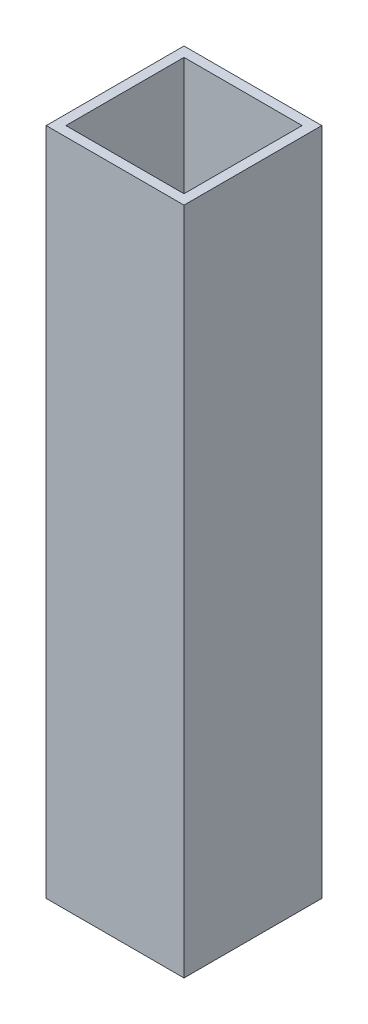
ISO-10303-21;
HEADER;
FILE_DESCRIPTION(('STEP AP214'),'2;1');
FILE_NAME('part.step','',(''),(''),'','','');
FILE_SCHEMA(('AUTOMOTIVE_DESIGN { 1 0 10303 214 1 1 1 1 }'));
ENDSEC;
DATA;
#1=APPLICATION_CONTEXT('core data for automotive mechanical design processes');
#2=APPLICATION_PROTOCOL_DEFINITION('international standard','automotive_design',2000,#1);
#3=PRODUCT_CONTEXT('',#1,'mechanical');
#4=PRODUCT('Part','Part','',(#3));
#5=PRODUCT_RELATED_PRODUCT_CATEGORY('part','',(#4));
#6=PRODUCT_DEFINITION_FORMATION('','',#4);
#7=PRODUCT_DEFINITION_CONTEXT('part definition',#1,'design');
#8=PRODUCT_DEFINITION('design','',#6,#7);
#9=PRODUCT_DEFINITION_SHAPE('','',#8);
#10=(LENGTH_UNIT() NAMED_UNIT(*) SI_UNIT(.MILLI.,.METRE.));
#11=(NAMED_UNIT(*) PLANE_ANGLE_UNIT() SI_UNIT($,.RADIAN.));
#12=(NAMED_UNIT(*) SI_UNIT($,.STERADIAN.) SOLID_ANGLE_UNIT());
#13=UNCERTAINTY_MEASURE_WITH_UNIT(LENGTH_MEASURE(1.E-05),#10,'distance_accuracy_value','');
#14=(GEOMETRIC_REPRESENTATION_CONTEXT(3) GLOBAL_UNCERTAINTY_ASSIGNED_CONTEXT((#13)) GLOBAL_UNIT_ASSIGNED_CONTEXT((#10,
#11,#12)) REPRESENTATION_CONTEXT('',''));
#15=CARTESIAN_POINT('',(0.,0.,0.));
#16=DIRECTION('',(0.,0.,1.));
#17=DIRECTION('',(1.,0.,0.));
#18=AXIS2_PLACEMENT_3D('',#15,#16,#17);
#19=CARTESIAN_POINT('',(1328.7375,260.35,-22.225));
#20=DIRECTION('',(0.,1.,0.));
#21=DIRECTION('',(-1.,0.,0.));
#22=AXIS2_PLACEMENT_3D('',#19,#20,#21);
#23=PLANE('',#22);
#24=DIRECTION('',(-1.,0.,0.));
#25=VECTOR('',#24,1.);
#26=CARTESIAN_POINT('',(2657.475,260.35,0.));
#27=LINE('',#26,#25);
#28=CARTESIAN_POINT('',(44.45,260.35,0.));
#29=VERTEX_POINT('',#28);
#30=CARTESIAN_POINT('',(0.,260.35,0.));
#31=VERTEX_POINT('',#30);
#32=EDGE_CURVE('E144',#29,#31,#27,.T.);
#33=ORIENTED_EDGE('',*,*,#32,.F.);
#34=DIRECTION('',(0.,0.,-1.));
#35=VECTOR('',#34,1.);
#36=CARTESIAN_POINT('',(44.45,260.35,-22.225));
#37=LINE('',#36,#35);
#38=CARTESIAN_POINT('',(44.45,260.35,-44.45));
#39=VERTEX_POINT('',#38);
#40=EDGE_CURVE('E148',#29,#39,#37,.T.);
#41=ORIENTED_EDGE('',*,*,#40,.T.);
#42=DIRECTION('',(-1.,0.,0.));
#43=VECTOR('',#42,1.);
#44=CARTESIAN_POINT('',(2657.475,260.35,-44.45));
#45=LINE('',#44,#43);
#46=CARTESIAN_POINT('',(0.,260.35,-44.45));
#47=VERTEX_POINT('',#46);
#48=EDGE_CURVE('E152',#39,#47,#45,.T.);
#49=ORIENTED_EDGE('',*,*,#48,.T.);
#50=DIRECTION('',(0.,0.,-1.));
#51=VECTOR('',#50,1.);
#52=CARTESIAN_POINT('',(0.,260.35,-22.225));
#53=LINE('',#52,#51);
#54=EDGE_CURVE('E155',#31,#47,#53,.T.);
#55=ORIENTED_EDGE('',*,*,#54,.F.);
#56=EDGE_LOOP('',(#33,#41,#49,#55));
#57=FACE_BOUND('',#56,.T.);
#58=DIRECTION('',(0.,0.,-1.));
#59=VECTOR('',#58,1.);
#60=CARTESIAN_POINT('',(41.275,260.35,-22.225));
#61=LINE('',#60,#59);
#62=CARTESIAN_POINT('',(41.275,260.35,-3.175));
#63=VERTEX_POINT('',#62);
#64=CARTESIAN_POINT('',(41.275,260.35,-41.275));
#65=VERTEX_POINT('',#64);
#66=EDGE_CURVE('E131',#63,#65,#61,.T.);
#67=ORIENTED_EDGE('',*,*,#66,.F.);
#68=DIRECTION('',(-1.,0.,0.));
#69=VECTOR('',#68,1.);
#70=CARTESIAN_POINT('',(2657.475,260.35,-3.175));
#71=LINE('',#70,#69);
#72=CARTESIAN_POINT('',(3.175,260.35,-3.175));
#73=VERTEX_POINT('',#72);
#74=EDGE_CURVE('E125',#63,#73,#71,.T.);
#75=ORIENTED_EDGE('',*,*,#74,.T.);
#76=DIRECTION('',(0.,0.,-1.));
#77=VECTOR('',#76,1.);
#78=CARTESIAN_POINT('',(3.175,260.35,-22.225));
#79=LINE('',#78,#77);
#80=CARTESIAN_POINT('',(3.175,260.35,-41.275));
#81=VERTEX_POINT('',#80);
#82=EDGE_CURVE('E107',#73,#81,#79,.T.);
#83=ORIENTED_EDGE('',*,*,#82,.T.);
#84=DIRECTION('',(-1.,0.,0.));
#85=VECTOR('',#84,1.);
#86=CARTESIAN_POINT('',(2657.475,260.35,-41.275));
#87=LINE('',#86,#85);
#88=EDGE_CURVE('E141',#65,#81,#87,.T.);
#89=ORIENTED_EDGE('',*,*,#88,.F.);
#90=EDGE_LOOP('',(#67,#75,#83,#89));
#91=FACE_BOUND('',#90,.T.);
#92=ADVANCED_FACE('F16',(#57,#91),#23,.T.);
#93=CARTESIAN_POINT('',(1328.7375,44.45,-22.225));
#94=DIRECTION('',(0.,1.,0.));
#95=DIRECTION('',(-1.,0.,0.));
#96=AXIS2_PLACEMENT_3D('',#93,#94,#95);
#97=PLANE('',#96);
#98=DIRECTION('',(-1.,0.,0.));
#99=VECTOR('',#98,1.);
#100=CARTESIAN_POINT('',(2657.475,44.45,0.));
#101=LINE('',#100,#99);
#102=CARTESIAN_POINT('',(44.45,44.45,0.));
#103=VERTEX_POINT('',#102);
#104=CARTESIAN_POINT('',(0.,44.45,0.));
#105=VERTEX_POINT('',#104);
#106=EDGE_CURVE('E160',#103,#105,#101,.T.);
#107=ORIENTED_EDGE('',*,*,#106,.T.);
#108=DIRECTION('',(0.,0.,-1.));
#109=VECTOR('',#108,1.);
#110=CARTESIAN_POINT('',(0.,44.45,-22.225));
#111=LINE('',#110,#109);
#112=CARTESIAN_POINT('',(0.,44.45,-44.45));
#113=VERTEX_POINT('',#112);
#114=EDGE_CURVE('E149',#105,#113,#111,.T.);
#115=ORIENTED_EDGE('',*,*,#114,.T.);
#116=DIRECTION('',(-1.,0.,0.));
#117=VECTOR('',#116,1.);
#118=CARTESIAN_POINT('',(2657.475,44.45,-44.45));
#119=LINE('',#118,#117);
#120=CARTESIAN_POINT('',(44.45,44.45,-44.45));
#121=VERTEX_POINT('',#120);
#122=EDGE_CURVE('E167',#121,#113,#119,.T.);
#123=ORIENTED_EDGE('',*,*,#122,.F.);
#124=DIRECTION('',(0.,0.,-1.));
#125=VECTOR('',#124,1.);
#126=CARTESIAN_POINT('',(44.45,44.45,-22.225));
#127=LINE('',#126,#125);
#128=EDGE_CURVE('E164',#103,#121,#127,.T.);
#129=ORIENTED_EDGE('',*,*,#128,.F.);
#130=EDGE_LOOP('',(#107,#115,#123,#129));
#131=FACE_BOUND('',#130,.T.);
#132=DIRECTION('',(-1.,0.,0.));
#133=VECTOR('',#132,1.);
#134=CARTESIAN_POINT('',(2657.475,44.45,-3.175));
#135=LINE('',#134,#133);
#136=CARTESIAN_POINT('',(41.275,44.45,-3.175));
#137=VERTEX_POINT('',#136);
#138=CARTESIAN_POINT('',(3.175,44.45,-3.175));
#139=VERTEX_POINT('',#138);
#140=EDGE_CURVE('E114',#137,#139,#135,.T.);
#141=ORIENTED_EDGE('',*,*,#140,.F.);
#142=DIRECTION('',(0.,0.,-1.));
#143=VECTOR('',#142,1.);
#144=CARTESIAN_POINT('',(41.275,44.45,-22.225));
#145=LINE('',#144,#143);
#146=CARTESIAN_POINT('',(41.275,44.45,-41.275));
#147=VERTEX_POINT('',#146);
#148=EDGE_CURVE('E121',#137,#147,#145,.T.);
#149=ORIENTED_EDGE('',*,*,#148,.T.);
#150=DIRECTION('',(-1.,0.,0.));
#151=VECTOR('',#150,1.);
#152=CARTESIAN_POINT('',(2657.475,44.45,-41.275));
#153=LINE('',#152,#151);
#154=CARTESIAN_POINT('',(3.175,44.45,-41.275));
#155=VERTEX_POINT('',#154);
#156=EDGE_CURVE('E48',#147,#155,#153,.T.);
#157=ORIENTED_EDGE('',*,*,#156,.T.);
#158=DIRECTION('',(0.,0.,-1.));
#159=VECTOR('',#158,1.);
#160=CARTESIAN_POINT('',(3.175,44.45,-22.225));
#161=LINE('',#160,#159);
#162=EDGE_CURVE('E105',#139,#155,#161,.T.);
#163=ORIENTED_EDGE('',*,*,#162,.F.);
#164=EDGE_LOOP('',(#141,#149,#157,#163));
#165=FACE_BOUND('',#164,.T.);
#166=ADVANCED_FACE('F123',(#131,#165),#97,.F.);
#167=CARTESIAN_POINT('',(2657.475,260.35,0.));
#168=DIRECTION('',(0.,0.,1.));
#169=DIRECTION('',(1.,0.,0.));
#170=AXIS2_PLACEMENT_3D('',#167,#168,#169);
#171=PLANE('',#170);
#172=ORIENTED_EDGE('',*,*,#106,.F.);
#173=DIRECTION('',(0.,-1.,0.));
#174=VECTOR('',#173,1.);
#175=CARTESIAN_POINT('',(44.45,260.35,0.));
#176=LINE('',#175,#174);
#177=EDGE_CURVE('E11',#29,#103,#176,.T.);
#178=ORIENTED_EDGE('',*,*,#177,.F.);
#179=ORIENTED_EDGE('',*,*,#32,.T.);
#180=DIRECTION('',(0.,-1.,0.));
#181=VECTOR('',#180,1.);
#182=CARTESIAN_POINT('',(0.,260.35,0.));
#183=LINE('',#182,#181);
#184=EDGE_CURVE('E159',#31,#105,#183,.T.);
#185=ORIENTED_EDGE('',*,*,#184,.T.);
#186=EDGE_LOOP('',(#172,#178,#179,#185));
#187=FACE_BOUND('',#186,.T.);
#188=ADVANCED_FACE('F18',(#187),#171,.T.);
#189=CARTESIAN_POINT('',(44.45,260.35,-22.225));
#190=DIRECTION('',(-1.,0.,0.));
#191=DIRECTION('',(0.,0.,1.));
#192=AXIS2_PLACEMENT_3D('',#189,#190,#191);
#193=PLANE('',#192);
#194=ORIENTED_EDGE('',*,*,#128,.T.);
#195=DIRECTION('',(0.,-1.,0.));
#196=VECTOR('',#195,1.);
#197=CARTESIAN_POINT('',(44.45,260.35,-44.45));
#198=LINE('',#197,#196);
#199=EDGE_CURVE('E25',#39,#121,#198,.T.);
#200=ORIENTED_EDGE('',*,*,#199,.F.);
#201=ORIENTED_EDGE('',*,*,#40,.F.);
#202=ORIENTED_EDGE('',*,*,#177,.T.);
#203=EDGE_LOOP('',(#194,#200,#201,#202));
#204=FACE_BOUND('',#203,.T.);
#205=ADVANCED_FACE('F199',(#204),#193,.F.);
#206=CARTESIAN_POINT('',(2657.475,260.35,-44.45));
#207=DIRECTION('',(0.,0.,1.));
#208=DIRECTION('',(1.,0.,0.));
#209=AXIS2_PLACEMENT_3D('',#206,#207,#208);
#210=PLANE('',#209);
#211=ORIENTED_EDGE('',*,*,#122,.T.);
#212=DIRECTION('',(0.,-1.,0.));
#213=VECTOR('',#212,1.);
#214=CARTESIAN_POINT('',(0.,260.35,-44.45));
#215=LINE('',#214,#213);
#216=EDGE_CURVE('E176',#47,#113,#215,.T.);
#217=ORIENTED_EDGE('',*,*,#216,.F.);
#218=ORIENTED_EDGE('',*,*,#48,.F.);
#219=ORIENTED_EDGE('',*,*,#199,.T.);
#220=EDGE_LOOP('',(#211,#217,#218,#219));
#221=FACE_BOUND('',#220,.T.);
#222=ADVANCED_FACE('F185',(#221),#210,.F.);
#223=CARTESIAN_POINT('',(0.,260.35,-22.225));
#224=DIRECTION('',(-1.,0.,0.));
#225=DIRECTION('',(0.,0.,1.));
#226=AXIS2_PLACEMENT_3D('',#223,#224,#225);
#227=PLANE('',#226);
#228=ORIENTED_EDGE('',*,*,#114,.F.);
#229=ORIENTED_EDGE('',*,*,#184,.F.);
#230=ORIENTED_EDGE('',*,*,#54,.T.);
#231=ORIENTED_EDGE('',*,*,#216,.T.);
#232=EDGE_LOOP('',(#228,#229,#230,#231));
#233=FACE_BOUND('',#232,.T.);
#234=ADVANCED_FACE('F194',(#233),#227,.T.);
#235=CARTESIAN_POINT('',(2657.475,260.35,-3.175));
#236=DIRECTION('',(0.,0.,1.));
#237=DIRECTION('',(1.,0.,0.));
#238=AXIS2_PLACEMENT_3D('',#235,#236,#237);
#239=PLANE('',#238);
#240=ORIENTED_EDGE('',*,*,#140,.T.);
#241=DIRECTION('',(0.,-1.,0.));
#242=VECTOR('',#241,1.);
#243=CARTESIAN_POINT('',(3.17500000000015,260.35,-3.175));
#244=LINE('',#243,#242);
#245=EDGE_CURVE('E101',#73,#139,#244,.T.);
#246=ORIENTED_EDGE('',*,*,#245,.F.);
#247=ORIENTED_EDGE('',*,*,#74,.F.);
#248=DIRECTION('',(0.,-1.,0.));
#249=VECTOR('',#248,1.);
#250=CARTESIAN_POINT('',(41.275,260.35,-3.175));
#251=LINE('',#250,#249);
#252=EDGE_CURVE('E116',#63,#137,#251,.T.);
#253=ORIENTED_EDGE('',*,*,#252,.T.);
#254=EDGE_LOOP('',(#240,#246,#247,#253));
#255=FACE_BOUND('',#254,.T.);
#256=ADVANCED_FACE('F115',(#255),#239,.F.);
#257=CARTESIAN_POINT('',(41.275,260.35,-22.225));
#258=DIRECTION('',(-1.,0.,0.));
#259=DIRECTION('',(0.,0.,1.));
#260=AXIS2_PLACEMENT_3D('',#257,#258,#259);
#261=PLANE('',#260);
#262=ORIENTED_EDGE('',*,*,#148,.F.);
#263=ORIENTED_EDGE('',*,*,#252,.F.);
#264=ORIENTED_EDGE('',*,*,#66,.T.);
#265=DIRECTION('',(0.,-1.,0.));
#266=VECTOR('',#265,1.);
#267=CARTESIAN_POINT('',(41.275,260.35,-41.275));
#268=LINE('',#267,#266);
#269=EDGE_CURVE('E362',#65,#147,#268,.T.);
#270=ORIENTED_EDGE('',*,*,#269,.T.);
#271=EDGE_LOOP('',(#262,#263,#264,#270));
#272=FACE_BOUND('',#271,.T.);
#273=ADVANCED_FACE('F234',(#272),#261,.T.);
#274=CARTESIAN_POINT('',(2657.475,260.35,-41.275));
#275=DIRECTION('',(0.,0.,1.));
#276=DIRECTION('',(1.,0.,0.));
#277=AXIS2_PLACEMENT_3D('',#274,#275,#276);
#278=PLANE('',#277);
#279=ORIENTED_EDGE('',*,*,#156,.F.);
#280=ORIENTED_EDGE('',*,*,#269,.F.);
#281=ORIENTED_EDGE('',*,*,#88,.T.);
#282=DIRECTION('',(0.,-1.,0.));
#283=VECTOR('',#282,1.);
#284=CARTESIAN_POINT('',(3.17500000000015,260.35,-41.275));
#285=LINE('',#284,#283);
#286=EDGE_CURVE('E37',#81,#155,#285,.T.);
#287=ORIENTED_EDGE('',*,*,#286,.T.);
#288=EDGE_LOOP('',(#279,#280,#281,#287));
#289=FACE_BOUND('',#288,.T.);
#290=ADVANCED_FACE('F241',(#289),#278,.T.);
#291=CARTESIAN_POINT('',(3.175,260.35,-22.225));
#292=DIRECTION('',(-1.,0.,0.));
#293=DIRECTION('',(0.,0.,1.));
#294=AXIS2_PLACEMENT_3D('',#291,#292,#293);
#295=PLANE('',#294);
#296=ORIENTED_EDGE('',*,*,#162,.T.);
#297=ORIENTED_EDGE('',*,*,#286,.F.);
#298=ORIENTED_EDGE('',*,*,#82,.F.);
#299=ORIENTED_EDGE('',*,*,#245,.T.);
#300=EDGE_LOOP('',(#296,#297,#298,#299));
#301=FACE_BOUND('',#300,.T.);
#302=ADVANCED_FACE('F103',(#301),#295,.F.);
#303=CLOSED_SHELL('',(#92,#166,#188,#205,#222,#234,#256,#273,#290,#302));
#304=MANIFOLD_SOLID_BREP('B1',#303);
#305=ADVANCED_BREP_SHAPE_REPRESENTATION('',(#18,#304),#14);
#306=SHAPE_DEFINITION_REPRESENTATION(#9,#305);
ENDSEC;
END-ISO-10303-21;
